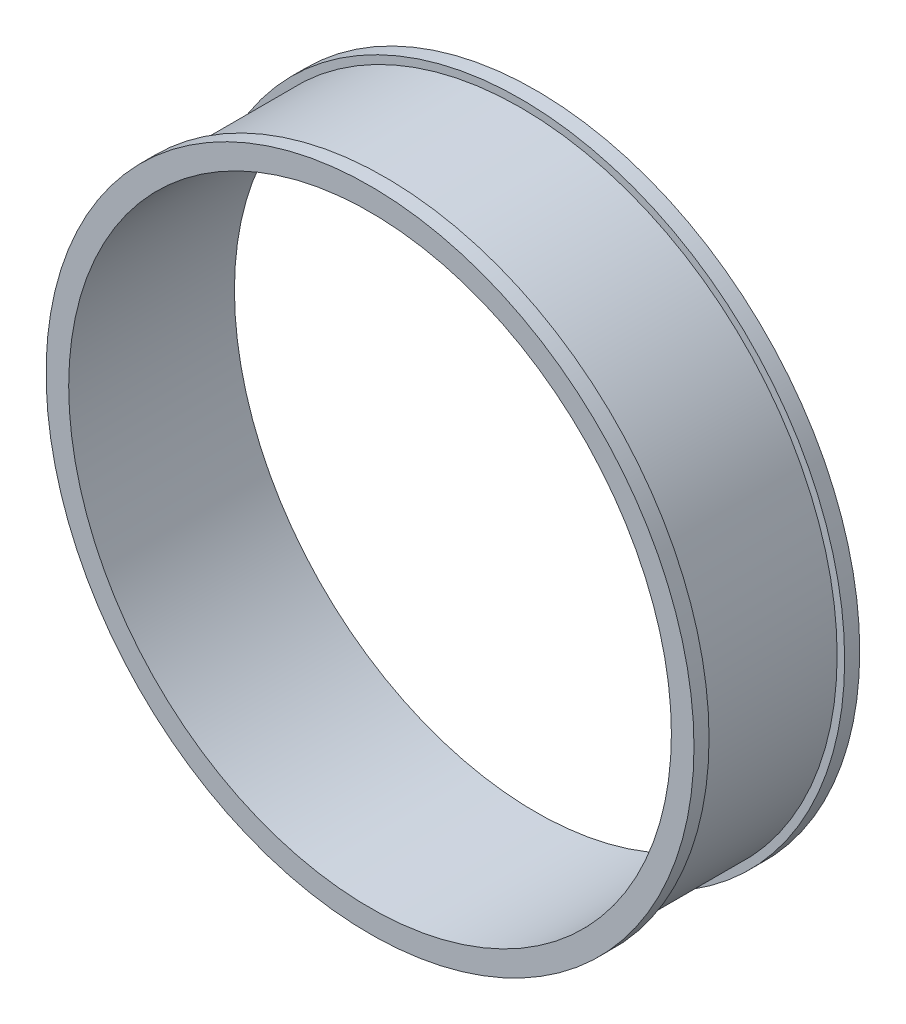
ISO-10303-21;
HEADER;
FILE_DESCRIPTION(('STEP AP214'),'2;1');
FILE_NAME('part.step','',(''),(''),'','','');
FILE_SCHEMA(('AUTOMOTIVE_DESIGN { 1 0 10303 214 1 1 1 1 }'));
ENDSEC;
DATA;
#1=APPLICATION_CONTEXT('core data for automotive mechanical design processes');
#2=APPLICATION_PROTOCOL_DEFINITION('international standard','automotive_design',2000,#1);
#3=PRODUCT_CONTEXT('',#1,'mechanical');
#4=PRODUCT('Part','Part','',(#3));
#5=PRODUCT_RELATED_PRODUCT_CATEGORY('part','',(#4));
#6=PRODUCT_DEFINITION_FORMATION('','',#4);
#7=PRODUCT_DEFINITION_CONTEXT('part definition',#1,'design');
#8=PRODUCT_DEFINITION('design','',#6,#7);
#9=PRODUCT_DEFINITION_SHAPE('','',#8);
#10=(LENGTH_UNIT() NAMED_UNIT(*) SI_UNIT(.MILLI.,.METRE.));
#11=(NAMED_UNIT(*) PLANE_ANGLE_UNIT() SI_UNIT($,.RADIAN.));
#12=(NAMED_UNIT(*) SI_UNIT($,.STERADIAN.) SOLID_ANGLE_UNIT());
#13=UNCERTAINTY_MEASURE_WITH_UNIT(LENGTH_MEASURE(1.E-05),#10,'distance_accuracy_value','');
#14=(GEOMETRIC_REPRESENTATION_CONTEXT(3) GLOBAL_UNCERTAINTY_ASSIGNED_CONTEXT((#13)) GLOBAL_UNIT_ASSIGNED_CONTEXT((#10,
#11,#12)) REPRESENTATION_CONTEXT('',''));
#15=CARTESIAN_POINT('',(0.,0.,0.));
#16=DIRECTION('',(0.,0.,1.));
#17=DIRECTION('',(1.,0.,0.));
#18=AXIS2_PLACEMENT_3D('',#15,#16,#17);
#19=CARTESIAN_POINT('',(0.,0.,131.756950561112));
#20=DIRECTION('',(0.,0.,1.));
#21=DIRECTION('',(1.,0.,0.));
#22=AXIS2_PLACEMENT_3D('',#19,#20,#21);
#23=CYLINDRICAL_SURFACE('',#22,210.);
#24=CARTESIAN_POINT('',(0.,0.,45.));
#25=DIRECTION('',(0.,0.,1.));
#26=DIRECTION('',(1.,0.,0.));
#27=AXIS2_PLACEMENT_3D('',#24,#25,#26);
#28=CIRCLE('',#27,210.);
#29=CARTESIAN_POINT('',(210.,0.,45.));
#30=VERTEX_POINT('',#29);
#31=EDGE_CURVE('E10',#30,#30,#28,.T.);
#32=ORIENTED_EDGE('',*,*,#31,.F.);
#33=EDGE_LOOP('',(#32));
#34=FACE_BOUND('',#33,.T.);
#35=CARTESIAN_POINT('',(0.,0.,-45.));
#36=DIRECTION('',(0.,0.,1.));
#37=DIRECTION('',(1.,0.,0.));
#38=AXIS2_PLACEMENT_3D('',#35,#36,#37);
#39=CIRCLE('',#38,210.);
#40=CARTESIAN_POINT('',(210.,0.,-45.));
#41=VERTEX_POINT('',#40);
#42=EDGE_CURVE('E65',#41,#41,#39,.T.);
#43=ORIENTED_EDGE('',*,*,#42,.T.);
#44=EDGE_LOOP('',(#43));
#45=FACE_BOUND('',#44,.T.);
#46=ADVANCED_FACE('F34',(#34,#45),#23,.T.);
#47=CARTESIAN_POINT('',(-210.,0.,45.));
#48=DIRECTION('',(0.,0.,1.));
#49=DIRECTION('',(1.,0.,0.));
#50=AXIS2_PLACEMENT_3D('',#47,#48,#49);
#51=PLANE('',#50);
#52=CARTESIAN_POINT('',(0.,0.,45.));
#53=DIRECTION('',(0.,0.,1.));
#54=DIRECTION('',(1.,0.,0.));
#55=AXIS2_PLACEMENT_3D('',#52,#53,#54);
#56=CIRCLE('',#55,215.);
#57=CARTESIAN_POINT('',(215.,0.,45.));
#58=VERTEX_POINT('',#57);
#59=EDGE_CURVE('E40',#58,#58,#56,.T.);
#60=ORIENTED_EDGE('',*,*,#59,.F.);
#61=EDGE_LOOP('',(#60));
#62=FACE_BOUND('',#61,.T.);
#63=ORIENTED_EDGE('',*,*,#31,.T.);
#64=EDGE_LOOP('',(#63));
#65=FACE_BOUND('',#64,.T.);
#66=ADVANCED_FACE('F103',(#62,#65),#51,.F.);
#67=CARTESIAN_POINT('',(0.,0.,131.756950561112));
#68=DIRECTION('',(0.,0.,1.));
#69=DIRECTION('',(1.,0.,0.));
#70=AXIS2_PLACEMENT_3D('',#67,#68,#69);
#71=CYLINDRICAL_SURFACE('',#70,215.);
#72=CARTESIAN_POINT('',(0.,0.,55.));
#73=DIRECTION('',(0.,0.,1.));
#74=DIRECTION('',(1.,0.,0.));
#75=AXIS2_PLACEMENT_3D('',#72,#73,#74);
#76=CIRCLE('',#75,215.);
#77=CARTESIAN_POINT('',(215.,0.,55.));
#78=VERTEX_POINT('',#77);
#79=EDGE_CURVE('E44',#78,#78,#76,.T.);
#80=ORIENTED_EDGE('',*,*,#79,.F.);
#81=EDGE_LOOP('',(#80));
#82=FACE_BOUND('',#81,.T.);
#83=ORIENTED_EDGE('',*,*,#59,.T.);
#84=EDGE_LOOP('',(#83));
#85=FACE_BOUND('',#84,.T.);
#86=ADVANCED_FACE('F98',(#82,#85),#71,.T.);
#87=CARTESIAN_POINT('',(-215.,0.,55.));
#88=DIRECTION('',(0.,0.,-1.));
#89=DIRECTION('',(-1.,0.,0.));
#90=AXIS2_PLACEMENT_3D('',#87,#88,#89);
#91=PLANE('',#90);
#92=CARTESIAN_POINT('',(0.,0.,55.));
#93=DIRECTION('',(0.,0.,1.));
#94=DIRECTION('',(1.,0.,0.));
#95=AXIS2_PLACEMENT_3D('',#92,#93,#94);
#96=CIRCLE('',#95,200.);
#97=CARTESIAN_POINT('',(200.,0.,55.));
#98=VERTEX_POINT('',#97);
#99=EDGE_CURVE('E48',#98,#98,#96,.T.);
#100=ORIENTED_EDGE('',*,*,#99,.F.);
#101=EDGE_LOOP('',(#100));
#102=FACE_BOUND('',#101,.T.);
#103=ORIENTED_EDGE('',*,*,#79,.T.);
#104=EDGE_LOOP('',(#103));
#105=FACE_BOUND('',#104,.T.);
#106=ADVANCED_FACE('F92',(#102,#105),#91,.F.);
#107=CARTESIAN_POINT('',(0.,0.,131.756950561112));
#108=DIRECTION('',(0.,0.,1.));
#109=DIRECTION('',(1.,0.,0.));
#110=AXIS2_PLACEMENT_3D('',#107,#108,#109);
#111=CYLINDRICAL_SURFACE('',#110,200.);
#112=CARTESIAN_POINT('',(0.,0.,-55.));
#113=DIRECTION('',(0.,0.,1.));
#114=DIRECTION('',(1.,0.,0.));
#115=AXIS2_PLACEMENT_3D('',#112,#113,#114);
#116=CIRCLE('',#115,200.);
#117=CARTESIAN_POINT('',(200.,0.,-55.));
#118=VERTEX_POINT('',#117);
#119=EDGE_CURVE('E53',#118,#118,#116,.T.);
#120=ORIENTED_EDGE('',*,*,#119,.F.);
#121=EDGE_LOOP('',(#120));
#122=FACE_BOUND('',#121,.T.);
#123=ORIENTED_EDGE('',*,*,#99,.T.);
#124=EDGE_LOOP('',(#123));
#125=FACE_BOUND('',#124,.T.);
#126=ADVANCED_FACE('F86',(#122,#125),#111,.F.);
#127=CARTESIAN_POINT('',(-215.,0.,-55.));
#128=DIRECTION('',(0.,0.,1.));
#129=DIRECTION('',(1.,0.,0.));
#130=AXIS2_PLACEMENT_3D('',#127,#128,#129);
#131=PLANE('',#130);
#132=CARTESIAN_POINT('',(0.,0.,-55.));
#133=DIRECTION('',(0.,0.,1.));
#134=DIRECTION('',(1.,0.,0.));
#135=AXIS2_PLACEMENT_3D('',#132,#133,#134);
#136=CIRCLE('',#135,215.);
#137=CARTESIAN_POINT('',(215.,0.,-55.));
#138=VERTEX_POINT('',#137);
#139=EDGE_CURVE('E57',#138,#138,#136,.T.);
#140=ORIENTED_EDGE('',*,*,#139,.F.);
#141=EDGE_LOOP('',(#140));
#142=FACE_BOUND('',#141,.T.);
#143=ORIENTED_EDGE('',*,*,#119,.T.);
#144=EDGE_LOOP('',(#143));
#145=FACE_BOUND('',#144,.T.);
#146=ADVANCED_FACE('F80',(#142,#145),#131,.F.);
#147=CARTESIAN_POINT('',(0.,0.,131.756950561112));
#148=DIRECTION('',(0.,0.,1.));
#149=DIRECTION('',(1.,0.,0.));
#150=AXIS2_PLACEMENT_3D('',#147,#148,#149);
#151=CYLINDRICAL_SURFACE('',#150,215.);
#152=CARTESIAN_POINT('',(0.,0.,-45.));
#153=DIRECTION('',(0.,0.,1.));
#154=DIRECTION('',(1.,0.,0.));
#155=AXIS2_PLACEMENT_3D('',#152,#153,#154);
#156=CIRCLE('',#155,215.);
#157=CARTESIAN_POINT('',(215.,0.,-45.));
#158=VERTEX_POINT('',#157);
#159=EDGE_CURVE('E61',#158,#158,#156,.T.);
#160=ORIENTED_EDGE('',*,*,#159,.F.);
#161=EDGE_LOOP('',(#160));
#162=FACE_BOUND('',#161,.T.);
#163=ORIENTED_EDGE('',*,*,#139,.T.);
#164=EDGE_LOOP('',(#163));
#165=FACE_BOUND('',#164,.T.);
#166=ADVANCED_FACE('F74',(#162,#165),#151,.T.);
#167=CARTESIAN_POINT('',(-210.,0.,-45.));
#168=DIRECTION('',(0.,0.,-1.));
#169=DIRECTION('',(-1.,0.,0.));
#170=AXIS2_PLACEMENT_3D('',#167,#168,#169);
#171=PLANE('',#170);
#172=ORIENTED_EDGE('',*,*,#42,.F.);
#173=EDGE_LOOP('',(#172));
#174=FACE_BOUND('',#173,.T.);
#175=ORIENTED_EDGE('',*,*,#159,.T.);
#176=EDGE_LOOP('',(#175));
#177=FACE_BOUND('',#176,.T.);
#178=ADVANCED_FACE('F71',(#174,#177),#171,.F.);
#179=CLOSED_SHELL('',(#46,#66,#86,#106,#126,#146,#166,#178));
#180=MANIFOLD_SOLID_BREP('B2',#179);
#181=ADVANCED_BREP_SHAPE_REPRESENTATION('',(#18,#180),#14);
#182=SHAPE_DEFINITION_REPRESENTATION(#9,#181);
ENDSEC;
END-ISO-10303-21;
